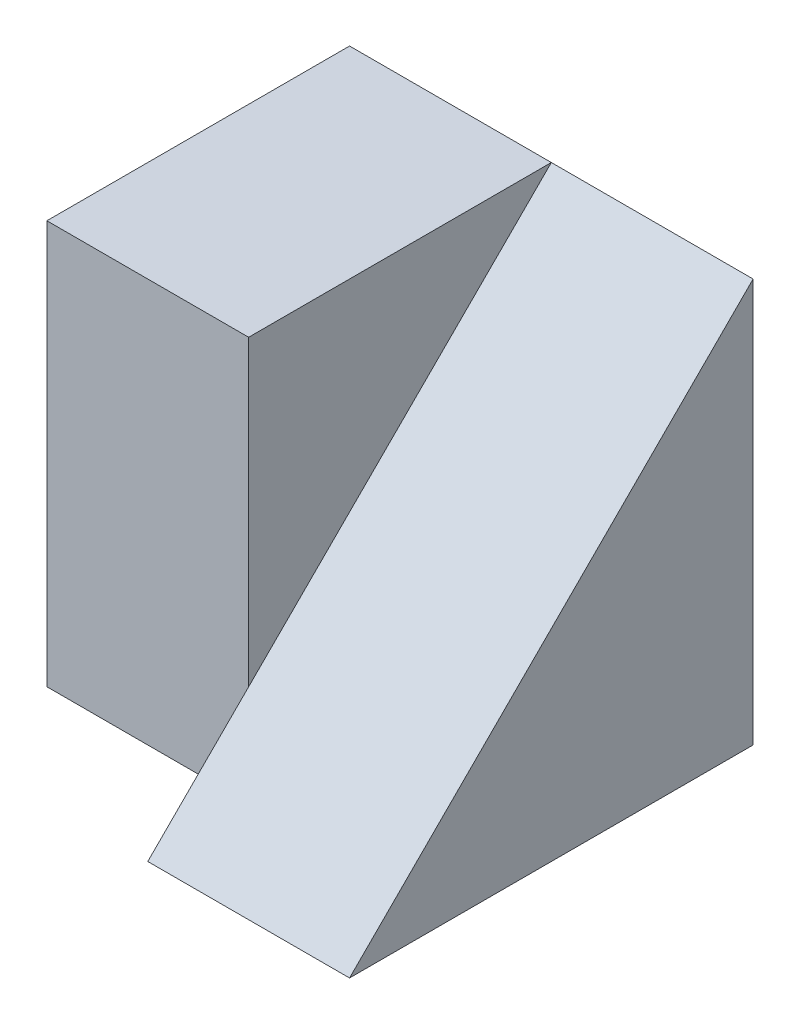
ISO-10303-21;
HEADER;
FILE_DESCRIPTION(('STEP AP214'),'2;1');
FILE_NAME('part.step','',(''),(''),'','','');
FILE_SCHEMA(('AUTOMOTIVE_DESIGN { 1 0 10303 214 1 1 1 1 }'));
ENDSEC;
DATA;
#1=APPLICATION_CONTEXT('core data for automotive mechanical design processes');
#2=APPLICATION_PROTOCOL_DEFINITION('international standard','automotive_design',2000,#1);
#3=PRODUCT_CONTEXT('',#1,'mechanical');
#4=PRODUCT('Part','Part','',(#3));
#5=PRODUCT_RELATED_PRODUCT_CATEGORY('part','',(#4));
#6=PRODUCT_DEFINITION_FORMATION('','',#4);
#7=PRODUCT_DEFINITION_CONTEXT('part definition',#1,'design');
#8=PRODUCT_DEFINITION('design','',#6,#7);
#9=PRODUCT_DEFINITION_SHAPE('','',#8);
#10=(LENGTH_UNIT() NAMED_UNIT(*) SI_UNIT(.MILLI.,.METRE.));
#11=(NAMED_UNIT(*) PLANE_ANGLE_UNIT() SI_UNIT($,.RADIAN.));
#12=(NAMED_UNIT(*) SI_UNIT($,.STERADIAN.) SOLID_ANGLE_UNIT());
#13=UNCERTAINTY_MEASURE_WITH_UNIT(LENGTH_MEASURE(1.E-05),#10,'distance_accuracy_value','');
#14=(GEOMETRIC_REPRESENTATION_CONTEXT(3) GLOBAL_UNCERTAINTY_ASSIGNED_CONTEXT((#13)) GLOBAL_UNIT_ASSIGNED_CONTEXT((#10,
#11,#12)) REPRESENTATION_CONTEXT('',''));
#15=CARTESIAN_POINT('',(0.,0.,0.));
#16=DIRECTION('',(0.,0.,1.));
#17=DIRECTION('',(1.,0.,0.));
#18=AXIS2_PLACEMENT_3D('',#15,#16,#17);
#19=CARTESIAN_POINT('',(2.,0.,0.));
#20=DIRECTION('',(0.,1.,0.));
#21=DIRECTION('',(0.,0.,1.));
#22=AXIS2_PLACEMENT_3D('',#19,#20,#21);
#23=PLANE('',#22);
#24=DIRECTION('',(0.,0.,1.));
#25=VECTOR('',#24,1.);
#26=CARTESIAN_POINT('',(0.,0.,0.));
#27=LINE('',#26,#25);
#28=CARTESIAN_POINT('',(0.,0.,-4.));
#29=VERTEX_POINT('',#28);
#30=CARTESIAN_POINT('',(0.,0.,-1.));
#31=VERTEX_POINT('',#30);
#32=EDGE_CURVE('E107',#29,#31,#27,.T.);
#33=ORIENTED_EDGE('',*,*,#32,.F.);
#34=DIRECTION('',(-1.,0.,0.));
#35=VECTOR('',#34,1.);
#36=CARTESIAN_POINT('',(2.,0.,-4.));
#37=LINE('',#36,#35);
#38=CARTESIAN_POINT('',(2.,0.,-4.));
#39=VERTEX_POINT('',#38);
#40=EDGE_CURVE('E41',#39,#29,#37,.T.);
#41=ORIENTED_EDGE('',*,*,#40,.F.);
#42=DIRECTION('',(0.,0.,-1.));
#43=VECTOR('',#42,1.);
#44=CARTESIAN_POINT('',(2.,0.,0.));
#45=LINE('',#44,#43);
#46=CARTESIAN_POINT('',(2.,0.,0.));
#47=VERTEX_POINT('',#46);
#48=EDGE_CURVE('E49',#47,#39,#45,.T.);
#49=ORIENTED_EDGE('',*,*,#48,.F.);
#50=DIRECTION('',(-1.,0.,0.));
#51=VECTOR('',#50,1.);
#52=CARTESIAN_POINT('',(2.,0.,0.));
#53=LINE('',#52,#51);
#54=CARTESIAN_POINT('',(0.,0.,0.));
#55=VERTEX_POINT('',#54);
#56=EDGE_CURVE('E11',#47,#55,#53,.T.);
#57=ORIENTED_EDGE('',*,*,#56,.T.);
#58=DIRECTION('',(0.,0.,-1.));
#59=VECTOR('',#58,1.);
#60=CARTESIAN_POINT('',(0.,0.,0.));
#61=LINE('',#60,#59);
#62=EDGE_CURVE('E122',#55,#31,#61,.T.);
#63=ORIENTED_EDGE('',*,*,#62,.T.);
#64=EDGE_LOOP('',(#33,#41,#49,#57,#63));
#65=FACE_BOUND('',#64,.T.);
#66=ADVANCED_FACE('F33',(#65),#23,.F.);
#67=CARTESIAN_POINT('',(2.,0.,-4.));
#68=DIRECTION('',(0.,0.,1.));
#69=DIRECTION('',(1.,0.,0.));
#70=AXIS2_PLACEMENT_3D('',#67,#68,#69);
#71=PLANE('',#70);
#72=DIRECTION('',(0.,-1.,0.));
#73=VECTOR('',#72,1.);
#74=CARTESIAN_POINT('',(0.,0.,-4.));
#75=LINE('',#74,#73);
#76=CARTESIAN_POINT('',(0.,4.,-4.));
#77=VERTEX_POINT('',#76);
#78=EDGE_CURVE('E106',#77,#29,#75,.T.);
#79=ORIENTED_EDGE('',*,*,#78,.F.);
#80=DIRECTION('',(-1.,0.,0.));
#81=VECTOR('',#80,1.);
#82=CARTESIAN_POINT('',(2.,4.,-4.));
#83=LINE('',#82,#81);
#84=CARTESIAN_POINT('',(2.,4.,-4.));
#85=VERTEX_POINT('',#84);
#86=EDGE_CURVE('E151',#85,#77,#83,.T.);
#87=ORIENTED_EDGE('',*,*,#86,.F.);
#88=DIRECTION('',(0.,1.,0.));
#89=VECTOR('',#88,1.);
#90=CARTESIAN_POINT('',(2.,0.,-4.));
#91=LINE('',#90,#89);
#92=EDGE_CURVE('E150',#39,#85,#91,.T.);
#93=ORIENTED_EDGE('',*,*,#92,.F.);
#94=ORIENTED_EDGE('',*,*,#40,.T.);
#95=EDGE_LOOP('',(#79,#87,#93,#94));
#96=FACE_BOUND('',#95,.T.);
#97=ADVANCED_FACE('F155',(#96),#71,.F.);
#98=CARTESIAN_POINT('',(2.,4.,0.));
#99=DIRECTION('',(0.,-1.,0.));
#100=DIRECTION('',(0.,0.,-1.));
#101=AXIS2_PLACEMENT_3D('',#98,#99,#100);
#102=PLANE('',#101);
#103=DIRECTION('',(0.,0.,1.));
#104=VECTOR('',#103,1.);
#105=CARTESIAN_POINT('',(0.,4.,0.));
#106=LINE('',#105,#104);
#107=CARTESIAN_POINT('',(0.,4.,-1.));
#108=VERTEX_POINT('',#107);
#109=EDGE_CURVE('E70',#77,#108,#106,.T.);
#110=ORIENTED_EDGE('',*,*,#109,.F.);
#111=CARTESIAN_POINT('',(-2.,4.,-4.));
#112=VERTEX_POINT('',#111);
#113=EDGE_CURVE('E103',#77,#112,#83,.T.);
#114=ORIENTED_EDGE('',*,*,#113,.T.);
#115=DIRECTION('',(0.,0.,-1.));
#116=VECTOR('',#115,1.);
#117=CARTESIAN_POINT('',(-2.,4.,-1.));
#118=LINE('',#117,#116);
#119=CARTESIAN_POINT('',(-2.,4.,-1.));
#120=VERTEX_POINT('',#119);
#121=EDGE_CURVE('E131',#120,#112,#118,.T.);
#122=ORIENTED_EDGE('',*,*,#121,.F.);
#123=DIRECTION('',(1.,0.,0.));
#124=VECTOR('',#123,1.);
#125=CARTESIAN_POINT('',(-2.,4.,-1.));
#126=LINE('',#125,#124);
#127=EDGE_CURVE('E128',#120,#108,#126,.T.);
#128=ORIENTED_EDGE('',*,*,#127,.T.);
#129=EDGE_LOOP('',(#110,#114,#122,#128));
#130=FACE_BOUND('',#129,.T.);
#131=ADVANCED_FACE('F159',(#130),#102,.F.);
#132=CARTESIAN_POINT('',(2.,0.,0.));
#133=DIRECTION('',(-1.,0.,0.));
#134=DIRECTION('',(0.,0.,1.));
#135=AXIS2_PLACEMENT_3D('',#132,#133,#134);
#136=PLANE('',#135);
#137=DIRECTION('',(0.,-0.707106781186548,0.707106781186548));
#138=VECTOR('',#137,1.);
#139=CARTESIAN_POINT('',(2.,0.,0.));
#140=LINE('',#139,#138);
#141=EDGE_CURVE('E165',#85,#47,#140,.T.);
#142=ORIENTED_EDGE('',*,*,#141,.T.);
#143=ORIENTED_EDGE('',*,*,#48,.T.);
#144=ORIENTED_EDGE('',*,*,#92,.T.);
#145=EDGE_LOOP('',(#142,#143,#144));
#146=FACE_BOUND('',#145,.T.);
#147=ADVANCED_FACE('F191',(#146),#136,.F.);
#148=CARTESIAN_POINT('',(0.,0.,0.));
#149=DIRECTION('',(-1.,0.,0.));
#150=DIRECTION('',(0.,0.,1.));
#151=AXIS2_PLACEMENT_3D('',#148,#149,#150);
#152=PLANE('',#151);
#153=ORIENTED_EDGE('',*,*,#62,.F.);
#154=DIRECTION('',(0.,-0.707106781186548,0.707106781186548));
#155=VECTOR('',#154,1.);
#156=CARTESIAN_POINT('',(0.,0.,0.));
#157=LINE('',#156,#155);
#158=CARTESIAN_POINT('',(0.,1.,-1.));
#159=VERTEX_POINT('',#158);
#160=EDGE_CURVE('E123',#159,#55,#157,.T.);
#161=ORIENTED_EDGE('',*,*,#160,.F.);
#162=DIRECTION('',(0.,1.,0.));
#163=VECTOR('',#162,1.);
#164=CARTESIAN_POINT('',(0.,0.,-1.));
#165=LINE('',#164,#163);
#166=EDGE_CURVE('E120',#31,#159,#165,.T.);
#167=ORIENTED_EDGE('',*,*,#166,.F.);
#168=EDGE_LOOP('',(#153,#161,#167));
#169=FACE_BOUND('',#168,.T.);
#170=ADVANCED_FACE('F121',(#169),#152,.T.);
#171=CARTESIAN_POINT('',(-2.,0.,-1.));
#172=DIRECTION('',(0.,0.,-1.));
#173=DIRECTION('',(-1.,0.,0.));
#174=AXIS2_PLACEMENT_3D('',#171,#172,#173);
#175=PLANE('',#174);
#176=ORIENTED_EDGE('',*,*,#166,.T.);
#177=EDGE_CURVE('E73',#159,#108,#165,.T.);
#178=ORIENTED_EDGE('',*,*,#177,.T.);
#179=ORIENTED_EDGE('',*,*,#127,.F.);
#180=DIRECTION('',(0.,1.,0.));
#181=VECTOR('',#180,1.);
#182=CARTESIAN_POINT('',(-2.,0.,-1.));
#183=LINE('',#182,#181);
#184=CARTESIAN_POINT('',(-2.,0.,-1.));
#185=VERTEX_POINT('',#184);
#186=EDGE_CURVE('E58',#185,#120,#183,.T.);
#187=ORIENTED_EDGE('',*,*,#186,.F.);
#188=DIRECTION('',(1.,0.,0.));
#189=VECTOR('',#188,1.);
#190=CARTESIAN_POINT('',(-2.,0.,-1.));
#191=LINE('',#190,#189);
#192=EDGE_CURVE('E101',#185,#31,#191,.T.);
#193=ORIENTED_EDGE('',*,*,#192,.T.);
#194=EDGE_LOOP('',(#176,#178,#179,#187,#193));
#195=FACE_BOUND('',#194,.T.);
#196=ADVANCED_FACE('F127',(#195),#175,.F.);
#197=CARTESIAN_POINT('',(-2.,0.,0.));
#198=DIRECTION('',(-1.,0.,0.));
#199=DIRECTION('',(0.,0.,1.));
#200=AXIS2_PLACEMENT_3D('',#197,#198,#199);
#201=PLANE('',#200);
#202=DIRECTION('',(0.,0.8,-0.6));
#203=VECTOR('',#202,1.);
#204=CARTESIAN_POINT('',(-2.,-0.48,-0.64));
#205=LINE('',#204,#203);
#206=EDGE_CURVE('E115',#185,#112,#205,.T.);
#207=ORIENTED_EDGE('',*,*,#206,.F.);
#208=ORIENTED_EDGE('',*,*,#186,.T.);
#209=ORIENTED_EDGE('',*,*,#121,.T.);
#210=EDGE_LOOP('',(#207,#208,#209));
#211=FACE_BOUND('',#210,.T.);
#212=ADVANCED_FACE('F160',(#211),#201,.T.);
#213=CARTESIAN_POINT('',(0.,0.,0.));
#214=DIRECTION('',(1.,0.,0.));
#215=DIRECTION('',(0.,0.,-1.));
#216=AXIS2_PLACEMENT_3D('',#213,#214,#215);
#217=PLANE('',#216);
#218=ORIENTED_EDGE('',*,*,#177,.F.);
#219=EDGE_CURVE('E164',#77,#159,#157,.T.);
#220=ORIENTED_EDGE('',*,*,#219,.F.);
#221=ORIENTED_EDGE('',*,*,#109,.T.);
#222=EDGE_LOOP('',(#218,#220,#221));
#223=FACE_BOUND('',#222,.T.);
#224=ADVANCED_FACE('F172',(#223),#217,.T.);
#225=CARTESIAN_POINT('',(0.,0.,0.));
#226=DIRECTION('',(0.,0.707106781186547,0.707106781186547));
#227=DIRECTION('',(0.,-0.707106781186548,0.707106781186548));
#228=AXIS2_PLACEMENT_3D('',#225,#226,#227);
#229=PLANE('',#228);
#230=ORIENTED_EDGE('',*,*,#141,.F.);
#231=ORIENTED_EDGE('',*,*,#86,.T.);
#232=ORIENTED_EDGE('',*,*,#219,.T.);
#233=ORIENTED_EDGE('',*,*,#160,.T.);
#234=ORIENTED_EDGE('',*,*,#56,.F.);
#235=EDGE_LOOP('',(#230,#231,#232,#233,#234));
#236=FACE_BOUND('',#235,.T.);
#237=ADVANCED_FACE('F171',(#236),#229,.T.);
#238=CARTESIAN_POINT('',(0.,-0.48,-0.64));
#239=DIRECTION('',(0.,0.6,0.8));
#240=DIRECTION('',(0.,-0.8,0.6));
#241=AXIS2_PLACEMENT_3D('',#238,#239,#240);
#242=PLANE('',#241);
#243=ORIENTED_EDGE('',*,*,#206,.T.);
#244=ORIENTED_EDGE('',*,*,#113,.F.);
#245=DIRECTION('',(0.,0.8,-0.6));
#246=VECTOR('',#245,1.);
#247=CARTESIAN_POINT('',(0.,-0.48,-0.64));
#248=LINE('',#247,#246);
#249=EDGE_CURVE('E97',#31,#77,#248,.T.);
#250=ORIENTED_EDGE('',*,*,#249,.F.);
#251=ORIENTED_EDGE('',*,*,#192,.F.);
#252=EDGE_LOOP('',(#243,#244,#250,#251));
#253=FACE_BOUND('',#252,.T.);
#254=ADVANCED_FACE('F99',(#253),#242,.F.);
#255=CARTESIAN_POINT('',(0.,0.,0.));
#256=DIRECTION('',(-1.,0.,0.));
#257=DIRECTION('',(0.,0.,1.));
#258=AXIS2_PLACEMENT_3D('',#255,#256,#257);
#259=PLANE('',#258);
#260=ORIENTED_EDGE('',*,*,#32,.T.);
#261=ORIENTED_EDGE('',*,*,#249,.T.);
#262=ORIENTED_EDGE('',*,*,#78,.T.);
#263=EDGE_LOOP('',(#260,#261,#262));
#264=FACE_BOUND('',#263,.T.);
#265=ADVANCED_FACE('F111',(#264),#259,.T.);
#266=CLOSED_SHELL('',(#66,#97,#131,#147,#170,#196,#212,#224,#237,#254,#265));
#267=MANIFOLD_SOLID_BREP('B2',#266);
#268=ADVANCED_BREP_SHAPE_REPRESENTATION('',(#18,#267),#14);
#269=SHAPE_DEFINITION_REPRESENTATION(#9,#268);
ENDSEC;
END-ISO-10303-21;
